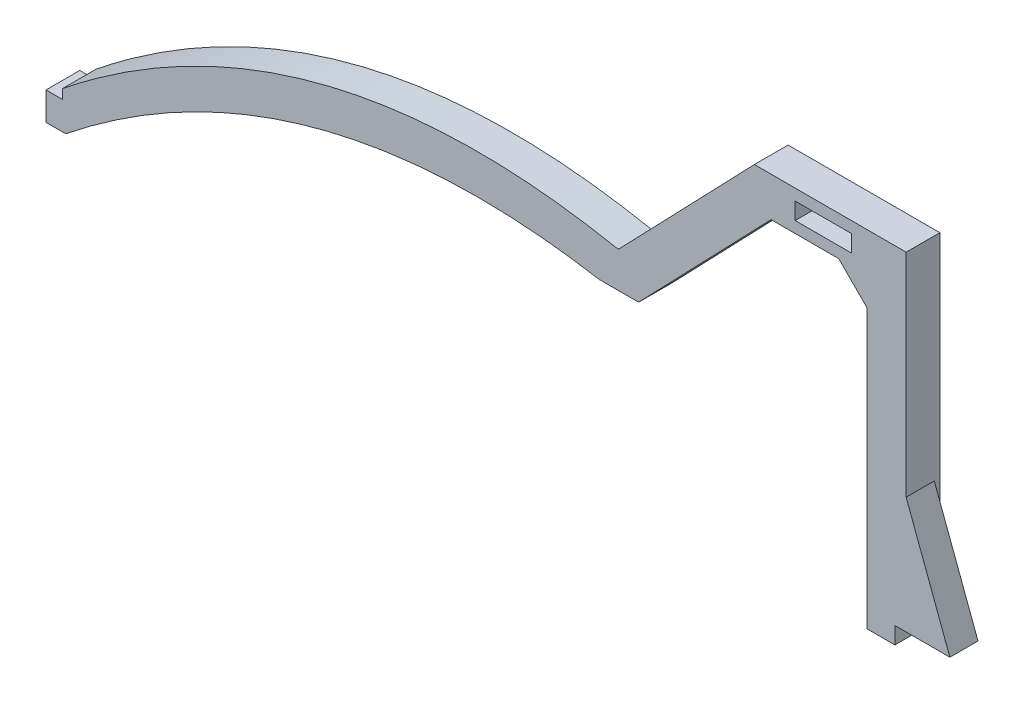
ISO-10303-21;
HEADER;
FILE_DESCRIPTION(('STEP AP214'),'2;1');
FILE_NAME('part.step','',(''),(''),'','','');
FILE_SCHEMA(('AUTOMOTIVE_DESIGN { 1 0 10303 214 1 1 1 1 }'));
ENDSEC;
DATA;
#1=APPLICATION_CONTEXT('core data for automotive mechanical design processes');
#2=APPLICATION_PROTOCOL_DEFINITION('international standard','automotive_design',2000,#1);
#3=PRODUCT_CONTEXT('',#1,'mechanical');
#4=PRODUCT('Part','Part','',(#3));
#5=PRODUCT_RELATED_PRODUCT_CATEGORY('part','',(#4));
#6=PRODUCT_DEFINITION_FORMATION('','',#4);
#7=PRODUCT_DEFINITION_CONTEXT('part definition',#1,'design');
#8=PRODUCT_DEFINITION('design','',#6,#7);
#9=PRODUCT_DEFINITION_SHAPE('','',#8);
#10=(LENGTH_UNIT() NAMED_UNIT(*) SI_UNIT(.MILLI.,.METRE.));
#11=(NAMED_UNIT(*) PLANE_ANGLE_UNIT() SI_UNIT($,.RADIAN.));
#12=(NAMED_UNIT(*) SI_UNIT($,.STERADIAN.) SOLID_ANGLE_UNIT());
#13=UNCERTAINTY_MEASURE_WITH_UNIT(LENGTH_MEASURE(1.E-05),#10,'distance_accuracy_value','');
#14=(GEOMETRIC_REPRESENTATION_CONTEXT(3) GLOBAL_UNCERTAINTY_ASSIGNED_CONTEXT((#13)) GLOBAL_UNIT_ASSIGNED_CONTEXT((#10,
#11,#12)) REPRESENTATION_CONTEXT('',''));
#15=CARTESIAN_POINT('',(0.,0.,0.));
#16=DIRECTION('',(0.,0.,1.));
#17=DIRECTION('',(1.,0.,0.));
#18=AXIS2_PLACEMENT_3D('',#15,#16,#17);
#19=CARTESIAN_POINT('',(149.489368047754,-7.,6.));
#20=DIRECTION('',(-1.,0.,0.));
#21=DIRECTION('',(0.,-1.,0.));
#22=AXIS2_PLACEMENT_3D('',#19,#20,#21);
#23=PLANE('',#22);
#24=DIRECTION('',(0.,0.,1.));
#25=VECTOR('',#24,1.);
#26=CARTESIAN_POINT('',(149.489368047754,13.7637883126724,1.));
#27=LINE('',#26,#25);
#28=CARTESIAN_POINT('',(149.489368047754,13.7637883126724,1.));
#29=VERTEX_POINT('',#28);
#30=CARTESIAN_POINT('',(149.489368047754,13.7637883126724,6.));
#31=VERTEX_POINT('',#30);
#32=EDGE_CURVE('E259',#29,#31,#27,.T.);
#33=ORIENTED_EDGE('',*,*,#32,.F.);
#34=DIRECTION('',(0.,-1.,0.));
#35=VECTOR('',#34,1.);
#36=CARTESIAN_POINT('',(149.489368047754,13.7637883126724,1.));
#37=LINE('',#36,#35);
#38=CARTESIAN_POINT('',(149.489368047754,-7.,1.));
#39=VERTEX_POINT('',#38);
#40=EDGE_CURVE('E243',#29,#39,#37,.T.);
#41=ORIENTED_EDGE('',*,*,#40,.T.);
#42=DIRECTION('',(0.,0.,-1.));
#43=VECTOR('',#42,1.);
#44=CARTESIAN_POINT('',(149.489368047754,-7.,6.));
#45=LINE('',#44,#43);
#46=CARTESIAN_POINT('',(149.489368047754,-7.,0.));
#47=VERTEX_POINT('',#46);
#48=EDGE_CURVE('E407',#39,#47,#45,.T.);
#49=ORIENTED_EDGE('',*,*,#48,.T.);
#50=DIRECTION('',(0.,1.,0.));
#51=VECTOR('',#50,1.);
#52=CARTESIAN_POINT('',(149.489368047754,-7.,0.));
#53=LINE('',#52,#51);
#54=CARTESIAN_POINT('',(149.489368047754,51.5049807047162,0.));
#55=VERTEX_POINT('',#54);
#56=EDGE_CURVE('E377',#47,#55,#53,.T.);
#57=ORIENTED_EDGE('',*,*,#56,.T.);
#58=DIRECTION('',(0.,0.,-1.));
#59=VECTOR('',#58,1.);
#60=CARTESIAN_POINT('',(149.489368047754,51.5049807047162,6.));
#61=LINE('',#60,#59);
#62=CARTESIAN_POINT('',(149.489368047754,51.5049807047162,6.));
#63=VERTEX_POINT('',#62);
#64=EDGE_CURVE('E403',#63,#55,#61,.T.);
#65=ORIENTED_EDGE('',*,*,#64,.F.);
#66=DIRECTION('',(0.,1.,0.));
#67=VECTOR('',#66,1.);
#68=CARTESIAN_POINT('',(149.489368047754,-7.,6.));
#69=LINE('',#68,#67);
#70=EDGE_CURVE('E492',#31,#63,#69,.T.);
#71=ORIENTED_EDGE('',*,*,#70,.F.);
#72=EDGE_LOOP('',(#33,#41,#49,#57,#65,#71));
#73=FACE_BOUND('',#72,.T.);
#74=ADVANCED_FACE('F39',(#73),#23,.F.);
#75=CARTESIAN_POINT('',(-0.533451553911542,1.70767056632672,6.));
#76=DIRECTION('',(0.999999999963749,-8.51478168667558E-06,0.));
#77=DIRECTION('',(8.51478168667558E-06,0.999999999963749,0.));
#78=AXIS2_PLACEMENT_3D('',#75,#76,#77);
#79=PLANE('',#78);
#80=DIRECTION('',(-8.51478168667558E-06,-0.999999999963749,0.));
#81=VECTOR('',#80,1.);
#82=CARTESIAN_POINT('',(-0.533451553911542,1.70767056632672,0.));
#83=LINE('',#82,#81);
#84=CARTESIAN_POINT('',(-0.533451553911542,1.70767056632672,0.));
#85=VERTEX_POINT('',#84);
#86=CARTESIAN_POINT('',(-0.533466094353608,0.,0.));
#87=VERTEX_POINT('',#86);
#88=EDGE_CURVE('E262',#85,#87,#83,.T.);
#89=ORIENTED_EDGE('',*,*,#88,.T.);
#90=DIRECTION('',(0.,0.,-1.));
#91=VECTOR('',#90,1.);
#92=CARTESIAN_POINT('',(-0.533466094353608,0.,6.));
#93=LINE('',#92,#91);
#94=CARTESIAN_POINT('',(-0.533466094353608,0.,6.));
#95=VERTEX_POINT('',#94);
#96=EDGE_CURVE('E324',#95,#87,#93,.T.);
#97=ORIENTED_EDGE('',*,*,#96,.F.);
#98=DIRECTION('',(-8.51478168667558E-06,-0.999999999963749,0.));
#99=VECTOR('',#98,1.);
#100=CARTESIAN_POINT('',(-0.533451553911542,1.70767056632672,6.));
#101=LINE('',#100,#99);
#102=CARTESIAN_POINT('',(-0.533451553911542,1.70767056632672,6.));
#103=VERTEX_POINT('',#102);
#104=EDGE_CURVE('E266',#103,#95,#101,.T.);
#105=ORIENTED_EDGE('',*,*,#104,.F.);
#106=DIRECTION('',(0.,0.,-1.));
#107=VECTOR('',#106,1.);
#108=CARTESIAN_POINT('',(-0.533451553911542,1.70767056632672,6.));
#109=LINE('',#108,#107);
#110=EDGE_CURVE('E326',#103,#85,#109,.T.);
#111=ORIENTED_EDGE('',*,*,#110,.T.);
#112=EDGE_LOOP('',(#89,#97,#105,#111));
#113=FACE_BOUND('',#112,.T.);
#114=ADVANCED_FACE('F309',(#113),#79,.F.);
#115=CARTESIAN_POINT('',(-0.533466094353608,0.,6.));
#116=DIRECTION('',(0.,-1.,0.));
#117=DIRECTION('',(1.,0.,0.));
#118=AXIS2_PLACEMENT_3D('',#115,#116,#117);
#119=PLANE('',#118);
#120=DIRECTION('',(-1.,0.,0.));
#121=VECTOR('',#120,1.);
#122=CARTESIAN_POINT('',(-0.533466094353608,0.,0.));
#123=LINE('',#122,#121);
#124=CARTESIAN_POINT('',(-3.5,0.,0.));
#125=VERTEX_POINT('',#124);
#126=EDGE_CURVE('E329',#87,#125,#123,.T.);
#127=ORIENTED_EDGE('',*,*,#126,.T.);
#128=DIRECTION('',(0.,0.,-1.));
#129=VECTOR('',#128,1.);
#130=CARTESIAN_POINT('',(-3.5,0.,6.));
#131=LINE('',#130,#129);
#132=CARTESIAN_POINT('',(-3.5,0.,6.));
#133=VERTEX_POINT('',#132);
#134=EDGE_CURVE('E442',#133,#125,#131,.T.);
#135=ORIENTED_EDGE('',*,*,#134,.F.);
#136=DIRECTION('',(-1.,0.,0.));
#137=VECTOR('',#136,1.);
#138=CARTESIAN_POINT('',(-0.533466094353608,0.,6.));
#139=LINE('',#138,#137);
#140=EDGE_CURVE('E270',#95,#133,#139,.T.);
#141=ORIENTED_EDGE('',*,*,#140,.F.);
#142=ORIENTED_EDGE('',*,*,#96,.T.);
#143=EDGE_LOOP('',(#127,#135,#141,#142));
#144=FACE_BOUND('',#143,.T.);
#145=ADVANCED_FACE('F306',(#144),#119,.F.);
#146=CARTESIAN_POINT('',(-3.5,0.,6.));
#147=DIRECTION('',(1.,0.,0.));
#148=DIRECTION('',(0.,1.,0.));
#149=AXIS2_PLACEMENT_3D('',#146,#147,#148);
#150=PLANE('',#149);
#151=DIRECTION('',(0.,-1.,0.));
#152=VECTOR('',#151,1.);
#153=CARTESIAN_POINT('',(-3.5,0.,0.));
#154=LINE('',#153,#152);
#155=CARTESIAN_POINT('',(-3.5,-5.,0.));
#156=VERTEX_POINT('',#155);
#157=EDGE_CURVE('E332',#125,#156,#154,.T.);
#158=ORIENTED_EDGE('',*,*,#157,.T.);
#159=DIRECTION('',(0.,0.,-1.));
#160=VECTOR('',#159,1.);
#161=CARTESIAN_POINT('',(-3.5,-5.,6.));
#162=LINE('',#161,#160);
#163=CARTESIAN_POINT('',(-3.5,-5.,6.));
#164=VERTEX_POINT('',#163);
#165=EDGE_CURVE('E438',#164,#156,#162,.T.);
#166=ORIENTED_EDGE('',*,*,#165,.F.);
#167=DIRECTION('',(0.,-1.,0.));
#168=VECTOR('',#167,1.);
#169=CARTESIAN_POINT('',(-3.5,0.,6.));
#170=LINE('',#169,#168);
#171=EDGE_CURVE('E274',#133,#164,#170,.T.);
#172=ORIENTED_EDGE('',*,*,#171,.F.);
#173=ORIENTED_EDGE('',*,*,#134,.T.);
#174=EDGE_LOOP('',(#158,#166,#172,#173));
#175=FACE_BOUND('',#174,.T.);
#176=ADVANCED_FACE('F302',(#175),#150,.F.);
#177=CARTESIAN_POINT('',(0.,-5.,6.));
#178=DIRECTION('',(0.,1.,0.));
#179=DIRECTION('',(0.,0.,1.));
#180=AXIS2_PLACEMENT_3D('',#177,#178,#179);
#181=PLANE('',#180);
#182=DIRECTION('',(1.,0.,0.));
#183=VECTOR('',#182,1.);
#184=CARTESIAN_POINT('',(0.,-5.,0.));
#185=LINE('',#184,#183);
#186=CARTESIAN_POINT('',(0.,-5.,0.));
#187=VERTEX_POINT('',#186);
#188=EDGE_CURVE('E343',#156,#187,#185,.T.);
#189=ORIENTED_EDGE('',*,*,#188,.T.);
#190=DIRECTION('',(0.,0.,-1.));
#191=VECTOR('',#190,1.);
#192=CARTESIAN_POINT('',(0.,-5.,6.));
#193=LINE('',#192,#191);
#194=CARTESIAN_POINT('',(0.,-5.,6.));
#195=VERTEX_POINT('',#194);
#196=EDGE_CURVE('E434',#195,#187,#193,.T.);
#197=ORIENTED_EDGE('',*,*,#196,.F.);
#198=DIRECTION('',(1.,0.,0.));
#199=VECTOR('',#198,1.);
#200=CARTESIAN_POINT('',(0.,-5.,6.));
#201=LINE('',#200,#199);
#202=EDGE_CURVE('E277',#164,#195,#201,.T.);
#203=ORIENTED_EDGE('',*,*,#202,.F.);
#204=ORIENTED_EDGE('',*,*,#165,.T.);
#205=EDGE_LOOP('',(#189,#197,#203,#204));
#206=FACE_BOUND('',#205,.T.);
#207=ADVANCED_FACE('F297',(#206),#181,.F.);
#208=CARTESIAN_POINT('',(0.,-5.,6.));
#209=CARTESIAN_POINT('',(42.6048179076836,29.035673617878,6.));
#210=CARTESIAN_POINT('',(94.9037876426475,20.,6.));
#211=B_SPLINE_CURVE_WITH_KNOTS('',2,(#208,#209,#210),.UNSPECIFIED.,.F.,.F.,(3,3),(0.,1.),.UNSPECIFIED.);
#212=DIRECTION('',(0.,0.,-1.));
#213=VECTOR('',#212,1.);
#214=SURFACE_OF_LINEAR_EXTRUSION('',#211,#213);
#215=CARTESIAN_POINT('',(0.,-5.,0.));
#216=CARTESIAN_POINT('',(42.6048179076836,29.035673617878,0.));
#217=CARTESIAN_POINT('',(94.9037876426475,20.,0.));
#218=B_SPLINE_CURVE_WITH_KNOTS('',2,(#215,#216,#217),.UNSPECIFIED.,.F.,.F.,(3,3),(0.,1.),.UNSPECIFIED.);
#219=CARTESIAN_POINT('',(94.9037876426475,20.,0.));
#220=VERTEX_POINT('',#219);
#221=EDGE_CURVE('E346',#187,#220,#218,.T.);
#222=ORIENTED_EDGE('',*,*,#221,.T.);
#223=DIRECTION('',(0.,0.,-1.));
#224=VECTOR('',#223,1.);
#225=CARTESIAN_POINT('',(94.9037876426475,20.,6.));
#226=LINE('',#225,#224);
#227=CARTESIAN_POINT('',(94.9037876426475,20.,6.));
#228=VERTEX_POINT('',#227);
#229=EDGE_CURVE('E430',#228,#220,#226,.T.);
#230=ORIENTED_EDGE('',*,*,#229,.F.);
#231=EDGE_CURVE('E280',#195,#228,#211,.T.);
#232=ORIENTED_EDGE('',*,*,#231,.F.);
#233=ORIENTED_EDGE('',*,*,#196,.T.);
#234=EDGE_LOOP('',(#222,#230,#232,#233));
#235=FACE_BOUND('',#234,.T.);
#236=ADVANCED_FACE('F292',(#235),#214,.F.);
#237=CARTESIAN_POINT('',(94.9037876426475,20.,6.));
#238=DIRECTION('',(0.,1.,0.));
#239=DIRECTION('',(-1.,0.,0.));
#240=AXIS2_PLACEMENT_3D('',#237,#238,#239);
#241=PLANE('',#240);
#242=DIRECTION('',(1.,0.,0.));
#243=VECTOR('',#242,1.);
#244=CARTESIAN_POINT('',(94.9037876426475,20.,0.));
#245=LINE('',#244,#243);
#246=CARTESIAN_POINT('',(101.903787642647,20.,0.));
#247=VERTEX_POINT('',#246);
#248=EDGE_CURVE('E351',#220,#247,#245,.T.);
#249=ORIENTED_EDGE('',*,*,#248,.T.);
#250=DIRECTION('',(0.,0.,-1.));
#251=VECTOR('',#250,1.);
#252=CARTESIAN_POINT('',(101.903787642647,20.,6.));
#253=LINE('',#252,#251);
#254=CARTESIAN_POINT('',(101.903787642647,20.,6.));
#255=VERTEX_POINT('',#254);
#256=EDGE_CURVE('E426',#255,#247,#253,.T.);
#257=ORIENTED_EDGE('',*,*,#256,.F.);
#258=DIRECTION('',(1.,0.,0.));
#259=VECTOR('',#258,1.);
#260=CARTESIAN_POINT('',(94.9037876426475,20.,6.));
#261=LINE('',#260,#259);
#262=EDGE_CURVE('E286',#228,#255,#261,.T.);
#263=ORIENTED_EDGE('',*,*,#262,.F.);
#264=ORIENTED_EDGE('',*,*,#229,.T.);
#265=EDGE_LOOP('',(#249,#257,#263,#264));
#266=FACE_BOUND('',#265,.T.);
#267=ADVANCED_FACE('F296',(#266),#241,.F.);
#268=CARTESIAN_POINT('',(101.903787642647,20.,6.));
#269=DIRECTION('',(-0.720788259928802,0.693155310409442,0.));
#270=DIRECTION('',(-0.693155310409442,-0.720788259928802,0.));
#271=AXIS2_PLACEMENT_3D('',#268,#269,#270);
#272=PLANE('',#271);
#273=DIRECTION('',(0.693155310409442,0.720788259928802,0.));
#274=VECTOR('',#273,1.);
#275=CARTESIAN_POINT('',(101.903787642647,20.,0.));
#276=LINE('',#275,#274);
#277=CARTESIAN_POINT('',(125.469317842366,44.5049807047162,0.));
#278=VERTEX_POINT('',#277);
#279=EDGE_CURVE('E357',#247,#278,#276,.T.);
#280=ORIENTED_EDGE('',*,*,#279,.T.);
#281=DIRECTION('',(0.,0.,-1.));
#282=VECTOR('',#281,1.);
#283=CARTESIAN_POINT('',(125.469317842366,44.5049807047162,6.));
#284=LINE('',#283,#282);
#285=CARTESIAN_POINT('',(125.469317842366,44.5049807047162,6.));
#286=VERTEX_POINT('',#285);
#287=EDGE_CURVE('E422',#286,#278,#284,.T.);
#288=ORIENTED_EDGE('',*,*,#287,.F.);
#289=DIRECTION('',(0.693155310409442,0.720788259928802,0.));
#290=VECTOR('',#289,1.);
#291=CARTESIAN_POINT('',(101.903787642647,20.,6.));
#292=LINE('',#291,#290);
#293=EDGE_CURVE('E484',#255,#286,#292,.T.);
#294=ORIENTED_EDGE('',*,*,#293,.F.);
#295=ORIENTED_EDGE('',*,*,#256,.T.);
#296=EDGE_LOOP('',(#280,#288,#294,#295));
#297=FACE_BOUND('',#296,.T.);
#298=ADVANCED_FACE('F566',(#297),#272,.F.);
#299=CARTESIAN_POINT('',(125.469317842366,44.5049807047162,6.));
#300=DIRECTION('',(0.,1.,0.));
#301=DIRECTION('',(-1.,0.,0.));
#302=AXIS2_PLACEMENT_3D('',#299,#300,#301);
#303=PLANE('',#302);
#304=DIRECTION('',(1.,0.,0.));
#305=VECTOR('',#304,1.);
#306=CARTESIAN_POINT('',(125.469317842366,44.5049807047162,0.));
#307=LINE('',#306,#305);
#308=CARTESIAN_POINT('',(137.489368047754,44.5049807047162,0.));
#309=VERTEX_POINT('',#308);
#310=EDGE_CURVE('E360',#278,#309,#307,.T.);
#311=ORIENTED_EDGE('',*,*,#310,.T.);
#312=DIRECTION('',(0.,0.,1.));
#313=VECTOR('',#312,1.);
#314=CARTESIAN_POINT('',(137.489368047754,44.5049807047162,6.));
#315=LINE('',#314,#313);
#316=CARTESIAN_POINT('',(137.489368047754,44.5049807047162,6.));
#317=VERTEX_POINT('',#316);
#318=EDGE_CURVE('E452',#309,#317,#315,.T.);
#319=ORIENTED_EDGE('',*,*,#318,.T.);
#320=DIRECTION('',(1.,0.,0.));
#321=VECTOR('',#320,1.);
#322=CARTESIAN_POINT('',(125.469317842366,44.5049807047162,6.));
#323=LINE('',#322,#321);
#324=EDGE_CURVE('E473',#286,#317,#323,.T.);
#325=ORIENTED_EDGE('',*,*,#324,.F.);
#326=ORIENTED_EDGE('',*,*,#287,.T.);
#327=EDGE_LOOP('',(#311,#319,#325,#326));
#328=FACE_BOUND('',#327,.T.);
#329=ADVANCED_FACE('F463',(#328),#303,.F.);
#330=CARTESIAN_POINT('',(142.489368047754,44.5049807047162,6.));
#331=DIRECTION('',(1.,0.,0.));
#332=DIRECTION('',(0.,0.,-1.));
#333=AXIS2_PLACEMENT_3D('',#330,#331,#332);
#334=PLANE('',#333);
#335=DIRECTION('',(0.,-1.,0.));
#336=VECTOR('',#335,1.);
#337=CARTESIAN_POINT('',(142.489368047754,44.5049807047162,6.));
#338=LINE('',#337,#336);
#339=CARTESIAN_POINT('',(142.489368047754,39.5049807047162,6.));
#340=VERTEX_POINT('',#339);
#341=CARTESIAN_POINT('',(142.489368047754,-10.,6.));
#342=VERTEX_POINT('',#341);
#343=EDGE_CURVE('E471',#340,#342,#338,.T.);
#344=ORIENTED_EDGE('',*,*,#343,.F.);
#345=DIRECTION('',(0.,0.,-1.));
#346=VECTOR('',#345,1.);
#347=CARTESIAN_POINT('',(142.489368047754,39.5049807047162,0.));
#348=LINE('',#347,#346);
#349=CARTESIAN_POINT('',(142.489368047754,39.5049807047162,0.));
#350=VERTEX_POINT('',#349);
#351=EDGE_CURVE('E448',#340,#350,#348,.T.);
#352=ORIENTED_EDGE('',*,*,#351,.T.);
#353=DIRECTION('',(0.,-1.,0.));
#354=VECTOR('',#353,1.);
#355=CARTESIAN_POINT('',(142.489368047754,44.5049807047162,0.));
#356=LINE('',#355,#354);
#357=CARTESIAN_POINT('',(142.489368047754,-10.,0.));
#358=VERTEX_POINT('',#357);
#359=EDGE_CURVE('E364',#350,#358,#356,.T.);
#360=ORIENTED_EDGE('',*,*,#359,.T.);
#361=DIRECTION('',(0.,0.,-1.));
#362=VECTOR('',#361,1.);
#363=CARTESIAN_POINT('',(142.489368047754,-10.,6.));
#364=LINE('',#363,#362);
#365=EDGE_CURVE('E418',#342,#358,#364,.T.);
#366=ORIENTED_EDGE('',*,*,#365,.F.);
#367=EDGE_LOOP('',(#344,#352,#360,#366));
#368=FACE_BOUND('',#367,.T.);
#369=ADVANCED_FACE('F475',(#368),#334,.F.);
#370=CARTESIAN_POINT('',(142.489368047754,-10.,6.));
#371=DIRECTION('',(0.,1.,0.));
#372=DIRECTION('',(-1.,0.,0.));
#373=AXIS2_PLACEMENT_3D('',#370,#371,#372);
#374=PLANE('',#373);
#375=DIRECTION('',(1.,0.,0.));
#376=VECTOR('',#375,1.);
#377=CARTESIAN_POINT('',(142.489368047754,-10.,0.));
#378=LINE('',#377,#376);
#379=CARTESIAN_POINT('',(147.489368047754,-10.,0.));
#380=VERTEX_POINT('',#379);
#381=EDGE_CURVE('E367',#358,#380,#378,.T.);
#382=ORIENTED_EDGE('',*,*,#381,.T.);
#383=DIRECTION('',(0.,0.,-1.));
#384=VECTOR('',#383,1.);
#385=CARTESIAN_POINT('',(147.489368047754,-10.,6.));
#386=LINE('',#385,#384);
#387=CARTESIAN_POINT('',(147.489368047754,-10.,6.));
#388=VERTEX_POINT('',#387);
#389=EDGE_CURVE('E414',#388,#380,#386,.T.);
#390=ORIENTED_EDGE('',*,*,#389,.F.);
#391=DIRECTION('',(1.,0.,0.));
#392=VECTOR('',#391,1.);
#393=CARTESIAN_POINT('',(142.489368047754,-10.,6.));
#394=LINE('',#393,#392);
#395=EDGE_CURVE('E478',#342,#388,#394,.T.);
#396=ORIENTED_EDGE('',*,*,#395,.F.);
#397=ORIENTED_EDGE('',*,*,#365,.T.);
#398=EDGE_LOOP('',(#382,#390,#396,#397));
#399=FACE_BOUND('',#398,.T.);
#400=ADVANCED_FACE('F529',(#399),#374,.F.);
#401=CARTESIAN_POINT('',(147.489368047754,-10.,6.));
#402=DIRECTION('',(-1.,0.,0.));
#403=DIRECTION('',(0.,0.,1.));
#404=AXIS2_PLACEMENT_3D('',#401,#402,#403);
#405=PLANE('',#404);
#406=DIRECTION('',(0.,1.,0.));
#407=VECTOR('',#406,1.);
#408=CARTESIAN_POINT('',(147.489368047754,-10.,0.));
#409=LINE('',#408,#407);
#410=CARTESIAN_POINT('',(147.489368047754,-7.,0.));
#411=VERTEX_POINT('',#410);
#412=EDGE_CURVE('E370',#380,#411,#409,.T.);
#413=ORIENTED_EDGE('',*,*,#412,.T.);
#414=DIRECTION('',(0.,0.,-1.));
#415=VECTOR('',#414,1.);
#416=CARTESIAN_POINT('',(147.489368047754,-7.,6.));
#417=LINE('',#416,#415);
#418=CARTESIAN_POINT('',(147.489368047754,-7.,6.));
#419=VERTEX_POINT('',#418);
#420=EDGE_CURVE('E410',#419,#411,#417,.T.);
#421=ORIENTED_EDGE('',*,*,#420,.F.);
#422=DIRECTION('',(0.,1.,0.));
#423=VECTOR('',#422,1.);
#424=CARTESIAN_POINT('',(147.489368047754,-10.,6.));
#425=LINE('',#424,#423);
#426=EDGE_CURVE('E482',#388,#419,#425,.T.);
#427=ORIENTED_EDGE('',*,*,#426,.F.);
#428=ORIENTED_EDGE('',*,*,#389,.T.);
#429=EDGE_LOOP('',(#413,#421,#427,#428));
#430=FACE_BOUND('',#429,.T.);
#431=ADVANCED_FACE('F526',(#430),#405,.F.);
#432=CARTESIAN_POINT('',(147.489368047754,-7.,6.));
#433=DIRECTION('',(0.,1.,0.));
#434=DIRECTION('',(0.,0.,1.));
#435=AXIS2_PLACEMENT_3D('',#432,#433,#434);
#436=PLANE('',#435);
#437=DIRECTION('',(1.,0.,0.));
#438=VECTOR('',#437,1.);
#439=CARTESIAN_POINT('',(147.489368047754,-7.,0.));
#440=LINE('',#439,#438);
#441=EDGE_CURVE('E373',#411,#47,#440,.T.);
#442=ORIENTED_EDGE('',*,*,#441,.T.);
#443=ORIENTED_EDGE('',*,*,#48,.F.);
#444=DIRECTION('',(1.,0.,0.));
#445=VECTOR('',#444,1.);
#446=CARTESIAN_POINT('',(149.489368047754,-7.,1.));
#447=LINE('',#446,#445);
#448=CARTESIAN_POINT('',(157.267488672421,-7.,1.));
#449=VERTEX_POINT('',#448);
#450=EDGE_CURVE('E247',#39,#449,#447,.T.);
#451=ORIENTED_EDGE('',*,*,#450,.T.);
#452=DIRECTION('',(0.,0.,1.));
#453=VECTOR('',#452,1.);
#454=CARTESIAN_POINT('',(157.267488672421,-7.,1.));
#455=LINE('',#454,#453);
#456=CARTESIAN_POINT('',(157.267488672421,-7.,6.));
#457=VERTEX_POINT('',#456);
#458=EDGE_CURVE('E255',#449,#457,#455,.T.);
#459=ORIENTED_EDGE('',*,*,#458,.T.);
#460=DIRECTION('',(1.,0.,0.));
#461=VECTOR('',#460,1.);
#462=CARTESIAN_POINT('',(147.489368047754,-7.,6.));
#463=LINE('',#462,#461);
#464=EDGE_CURVE('E489',#419,#457,#463,.T.);
#465=ORIENTED_EDGE('',*,*,#464,.F.);
#466=ORIENTED_EDGE('',*,*,#420,.T.);
#467=EDGE_LOOP('',(#442,#443,#451,#459,#465,#466));
#468=FACE_BOUND('',#467,.T.);
#469=ADVANCED_FACE('F521',(#468),#436,.F.);
#470=CARTESIAN_POINT('',(122.489368047754,51.5049807047162,6.));
#471=DIRECTION('',(0.,-1.,0.));
#472=DIRECTION('',(1.,0.,0.));
#473=AXIS2_PLACEMENT_3D('',#470,#471,#472);
#474=PLANE('',#473);
#475=DIRECTION('',(-1.,0.,0.));
#476=VECTOR('',#475,1.);
#477=CARTESIAN_POINT('',(122.489368047754,51.5049807047162,0.));
#478=LINE('',#477,#476);
#479=CARTESIAN_POINT('',(122.489368047754,51.5049807047162,0.));
#480=VERTEX_POINT('',#479);
#481=EDGE_CURVE('E380',#55,#480,#478,.T.);
#482=ORIENTED_EDGE('',*,*,#481,.T.);
#483=DIRECTION('',(0.,0.,-1.));
#484=VECTOR('',#483,1.);
#485=CARTESIAN_POINT('',(122.489368047754,51.5049807047162,6.));
#486=LINE('',#485,#484);
#487=CARTESIAN_POINT('',(122.489368047754,51.5049807047162,6.));
#488=VERTEX_POINT('',#487);
#489=EDGE_CURVE('E399',#488,#480,#486,.T.);
#490=ORIENTED_EDGE('',*,*,#489,.F.);
#491=DIRECTION('',(-1.,0.,0.));
#492=VECTOR('',#491,1.);
#493=CARTESIAN_POINT('',(122.489368047754,51.5049807047162,6.));
#494=LINE('',#493,#492);
#495=EDGE_CURVE('E495',#63,#488,#494,.T.);
#496=ORIENTED_EDGE('',*,*,#495,.F.);
#497=ORIENTED_EDGE('',*,*,#64,.T.);
#498=EDGE_LOOP('',(#482,#490,#496,#497));
#499=FACE_BOUND('',#498,.T.);
#500=ADVANCED_FACE('F513',(#499),#474,.F.);
#501=CARTESIAN_POINT('',(98.2958228569671,26.3469489076645,6.));
#502=DIRECTION('',(0.720788259928802,-0.693155310409442,0.));
#503=DIRECTION('',(0.693155310409442,0.720788259928802,0.));
#504=AXIS2_PLACEMENT_3D('',#501,#502,#503);
#505=PLANE('',#504);
#506=DIRECTION('',(-0.693155310409442,-0.720788259928802,0.));
#507=VECTOR('',#506,1.);
#508=CARTESIAN_POINT('',(98.2958228569671,26.3469489076645,0.));
#509=LINE('',#508,#507);
#510=CARTESIAN_POINT('',(98.2958228569671,26.3469489076645,0.));
#511=VERTEX_POINT('',#510);
#512=EDGE_CURVE('E383',#480,#511,#509,.T.);
#513=ORIENTED_EDGE('',*,*,#512,.T.);
#514=DIRECTION('',(0.,0.,-1.));
#515=VECTOR('',#514,1.);
#516=CARTESIAN_POINT('',(98.2958228569671,26.3469489076645,6.));
#517=LINE('',#516,#515);
#518=CARTESIAN_POINT('',(98.2958228569671,26.3469489076645,6.));
#519=VERTEX_POINT('',#518);
#520=EDGE_CURVE('E395',#519,#511,#517,.T.);
#521=ORIENTED_EDGE('',*,*,#520,.F.);
#522=DIRECTION('',(-0.693155310409442,-0.720788259928802,0.));
#523=VECTOR('',#522,1.);
#524=CARTESIAN_POINT('',(98.2958228569671,26.3469489076645,6.));
#525=LINE('',#524,#523);
#526=EDGE_CURVE('E497',#488,#519,#525,.T.);
#527=ORIENTED_EDGE('',*,*,#526,.F.);
#528=ORIENTED_EDGE('',*,*,#489,.T.);
#529=EDGE_LOOP('',(#513,#521,#527,#528));
#530=FACE_BOUND('',#529,.T.);
#531=ADVANCED_FACE('F509',(#530),#505,.F.);
#532=CARTESIAN_POINT('',(98.2958228569671,26.3469489076645,6.));
#533=CARTESIAN_POINT('',(98.0268187157122,26.4004726348545,6.));
#534=CARTESIAN_POINT('',(61.7178736480908,33.5155245541601,6.));
#535=CARTESIAN_POINT('',(28.7998876093949,25.1881012839885,6.));
#536=CARTESIAN_POINT('',(-0.533451553911542,1.70767056632672,6.));
#537=B_SPLINE_CURVE_WITH_KNOTS('',3,(#532,#533,#534,#535,#536),.UNSPECIFIED.,.F.,.F.,(4,1,4),
(0.,0.00745886026553855,1.00745886026554),.UNSPECIFIED.);
#538=DIRECTION('',(0.,0.,-1.));
#539=VECTOR('',#538,1.);
#540=SURFACE_OF_LINEAR_EXTRUSION('',#537,#539);
#541=CARTESIAN_POINT('',(98.2958228569671,26.3469489076645,0.));
#542=CARTESIAN_POINT('',(98.0268187157122,26.4004726348545,0.));
#543=CARTESIAN_POINT('',(61.7178736480908,33.5155245541601,0.));
#544=CARTESIAN_POINT('',(28.7998876093949,25.1881012839885,0.));
#545=CARTESIAN_POINT('',(-0.533451553911542,1.70767056632672,0.));
#546=B_SPLINE_CURVE_WITH_KNOTS('',3,(#541,#542,#543,#544,#545),.UNSPECIFIED.,.F.,.F.,(4,1,4),
(0.,0.00745886026553855,1.00745886026554),.UNSPECIFIED.);
#547=EDGE_CURVE('E271',#511,#85,#546,.T.);
#548=ORIENTED_EDGE('',*,*,#547,.T.);
#549=ORIENTED_EDGE('',*,*,#110,.F.);
#550=EDGE_CURVE('E335',#519,#103,#537,.T.);
#551=ORIENTED_EDGE('',*,*,#550,.F.);
#552=ORIENTED_EDGE('',*,*,#520,.T.);
#553=EDGE_LOOP('',(#548,#549,#551,#552));
#554=FACE_BOUND('',#553,.T.);
#555=ADVANCED_FACE('F504',(#554),#540,.F.);
#556=CARTESIAN_POINT('',(45.0283558645037,18.267836808939,6.));
#557=DIRECTION('',(0.,0.,1.));
#558=DIRECTION('',(1.,0.,0.));
#559=AXIS2_PLACEMENT_3D('',#556,#557,#558);
#560=PLANE('',#559);
#561=DIRECTION('',(0.,-1.,0.));
#562=VECTOR('',#561,1.);
#563=CARTESIAN_POINT('',(129.74873736035,49.5049807047162,6.));
#564=LINE('',#563,#562);
#565=CARTESIAN_POINT('',(129.74873736035,49.5049807047162,6.));
#566=VERTEX_POINT('',#565);
#567=CARTESIAN_POINT('',(129.74873736035,46.5049807047162,6.));
#568=VERTEX_POINT('',#567);
#569=EDGE_CURVE('E55',#566,#568,#564,.T.);
#570=ORIENTED_EDGE('',*,*,#569,.F.);
#571=DIRECTION('',(-1.,0.,0.));
#572=VECTOR('',#571,1.);
#573=CARTESIAN_POINT('',(129.74873736035,49.5049807047162,6.));
#574=LINE('',#573,#572);
#575=CARTESIAN_POINT('',(139.74873736035,49.5049807047162,6.));
#576=VERTEX_POINT('',#575);
#577=EDGE_CURVE('E215',#576,#566,#574,.T.);
#578=ORIENTED_EDGE('',*,*,#577,.F.);
#579=DIRECTION('',(0.,1.,0.));
#580=VECTOR('',#579,1.);
#581=CARTESIAN_POINT('',(139.74873736035,49.5049807047162,6.));
#582=LINE('',#581,#580);
#583=CARTESIAN_POINT('',(139.74873736035,46.5049807047162,6.));
#584=VERTEX_POINT('',#583);
#585=EDGE_CURVE('E219',#584,#576,#582,.T.);
#586=ORIENTED_EDGE('',*,*,#585,.F.);
#587=DIRECTION('',(1.,0.,0.));
#588=VECTOR('',#587,1.);
#589=CARTESIAN_POINT('',(129.74873736035,46.5049807047162,6.));
#590=LINE('',#589,#588);
#591=EDGE_CURVE('E228',#568,#584,#590,.T.);
#592=ORIENTED_EDGE('',*,*,#591,.F.);
#593=EDGE_LOOP('',(#570,#578,#586,#592));
#594=FACE_BOUND('',#593,.T.);
#595=ORIENTED_EDGE('',*,*,#104,.T.);
#596=ORIENTED_EDGE('',*,*,#140,.T.);
#597=ORIENTED_EDGE('',*,*,#171,.T.);
#598=ORIENTED_EDGE('',*,*,#202,.T.);
#599=ORIENTED_EDGE('',*,*,#231,.T.);
#600=ORIENTED_EDGE('',*,*,#262,.T.);
#601=ORIENTED_EDGE('',*,*,#293,.T.);
#602=ORIENTED_EDGE('',*,*,#324,.T.);
#603=DIRECTION('',(-0.707106781186547,0.707106781186548,0.));
#604=VECTOR('',#603,1.);
#605=CARTESIAN_POINT('',(142.489368047754,39.5049807047162,6.));
#606=LINE('',#605,#604);
#607=EDGE_CURVE('E11',#317,#340,#606,.F.);
#608=ORIENTED_EDGE('',*,*,#607,.T.);
#609=ORIENTED_EDGE('',*,*,#343,.T.);
#610=ORIENTED_EDGE('',*,*,#395,.T.);
#611=ORIENTED_EDGE('',*,*,#426,.T.);
#612=ORIENTED_EDGE('',*,*,#464,.T.);
#613=DIRECTION('',(-0.350795238718328,0.936452188044084,0.));
#614=VECTOR('',#613,1.);
#615=CARTESIAN_POINT('',(157.267488672421,-7.,6.));
#616=LINE('',#615,#614);
#617=EDGE_CURVE('E237',#457,#31,#616,.T.);
#618=ORIENTED_EDGE('',*,*,#617,.T.);
#619=ORIENTED_EDGE('',*,*,#70,.T.);
#620=ORIENTED_EDGE('',*,*,#495,.T.);
#621=ORIENTED_EDGE('',*,*,#526,.T.);
#622=ORIENTED_EDGE('',*,*,#550,.T.);
#623=EDGE_LOOP('',(#595,#596,#597,#598,#599,#600,#601,#602,#608,#609,#610,#611,#612,#618,#619,
#620,#621,#622));
#624=FACE_BOUND('',#623,.T.);
#625=ADVANCED_FACE('F470',(#594,#624),#560,.T.);
#626=CARTESIAN_POINT('',(45.0283558645037,18.267836808939,0.));
#627=DIRECTION('',(0.,0.,1.));
#628=DIRECTION('',(1.,0.,0.));
#629=AXIS2_PLACEMENT_3D('',#626,#627,#628);
#630=PLANE('',#629);
#631=DIRECTION('',(-1.,0.,0.));
#632=VECTOR('',#631,1.);
#633=CARTESIAN_POINT('',(129.74873736035,49.5049807047162,0.));
#634=LINE('',#633,#632);
#635=CARTESIAN_POINT('',(139.74873736035,49.5049807047162,0.));
#636=VERTEX_POINT('',#635);
#637=CARTESIAN_POINT('',(129.74873736035,49.5049807047162,0.));
#638=VERTEX_POINT('',#637);
#639=EDGE_CURVE('E203',#636,#638,#634,.T.);
#640=ORIENTED_EDGE('',*,*,#639,.T.);
#641=DIRECTION('',(0.,-1.,0.));
#642=VECTOR('',#641,1.);
#643=CARTESIAN_POINT('',(129.74873736035,49.5049807047162,0.));
#644=LINE('',#643,#642);
#645=CARTESIAN_POINT('',(129.74873736035,46.5049807047162,0.));
#646=VERTEX_POINT('',#645);
#647=EDGE_CURVE('E196',#638,#646,#644,.T.);
#648=ORIENTED_EDGE('',*,*,#647,.T.);
#649=DIRECTION('',(1.,0.,0.));
#650=VECTOR('',#649,1.);
#651=CARTESIAN_POINT('',(129.74873736035,46.5049807047162,0.));
#652=LINE('',#651,#650);
#653=CARTESIAN_POINT('',(139.74873736035,46.5049807047162,0.));
#654=VERTEX_POINT('',#653);
#655=EDGE_CURVE('E206',#646,#654,#652,.T.);
#656=ORIENTED_EDGE('',*,*,#655,.T.);
#657=DIRECTION('',(0.,1.,0.));
#658=VECTOR('',#657,1.);
#659=CARTESIAN_POINT('',(139.74873736035,49.5049807047162,0.));
#660=LINE('',#659,#658);
#661=EDGE_CURVE('E63',#654,#636,#660,.T.);
#662=ORIENTED_EDGE('',*,*,#661,.T.);
#663=EDGE_LOOP('',(#640,#648,#656,#662));
#664=FACE_BOUND('',#663,.T.);
#665=ORIENTED_EDGE('',*,*,#88,.F.);
#666=ORIENTED_EDGE('',*,*,#547,.F.);
#667=ORIENTED_EDGE('',*,*,#512,.F.);
#668=ORIENTED_EDGE('',*,*,#481,.F.);
#669=ORIENTED_EDGE('',*,*,#56,.F.);
#670=ORIENTED_EDGE('',*,*,#441,.F.);
#671=ORIENTED_EDGE('',*,*,#412,.F.);
#672=ORIENTED_EDGE('',*,*,#381,.F.);
#673=ORIENTED_EDGE('',*,*,#359,.F.);
#674=DIRECTION('',(0.707106781186547,-0.707106781186548,0.));
#675=VECTOR('',#674,1.);
#676=CARTESIAN_POINT('',(104.377433904017,77.6169148484526,0.));
#677=LINE('',#676,#675);
#678=EDGE_CURVE('E48',#350,#309,#677,.F.);
#679=ORIENTED_EDGE('',*,*,#678,.T.);
#680=ORIENTED_EDGE('',*,*,#310,.F.);
#681=ORIENTED_EDGE('',*,*,#279,.F.);
#682=ORIENTED_EDGE('',*,*,#248,.F.);
#683=ORIENTED_EDGE('',*,*,#221,.F.);
#684=ORIENTED_EDGE('',*,*,#188,.F.);
#685=ORIENTED_EDGE('',*,*,#157,.F.);
#686=ORIENTED_EDGE('',*,*,#126,.F.);
#687=EDGE_LOOP('',(#665,#666,#667,#668,#669,#670,#671,#672,#673,#679,#680,#681,#682,#683,#684,
#685,#686));
#688=FACE_BOUND('',#687,.T.);
#689=ADVANCED_FACE('F211',(#664,#688),#630,.F.);
#690=CARTESIAN_POINT('',(157.267488672421,-7.,1.));
#691=DIRECTION('',(0.936452188044084,0.350795238718328,0.));
#692=DIRECTION('',(-0.350795238718328,0.936452188044084,0.));
#693=AXIS2_PLACEMENT_3D('',#690,#691,#692);
#694=PLANE('',#693);
#695=ORIENTED_EDGE('',*,*,#617,.F.);
#696=ORIENTED_EDGE('',*,*,#458,.F.);
#697=DIRECTION('',(-0.350795238718328,0.936452188044084,0.));
#698=VECTOR('',#697,1.);
#699=CARTESIAN_POINT('',(157.267488672421,-7.,1.));
#700=LINE('',#699,#698);
#701=EDGE_CURVE('E251',#449,#29,#700,.T.);
#702=ORIENTED_EDGE('',*,*,#701,.T.);
#703=ORIENTED_EDGE('',*,*,#32,.T.);
#704=EDGE_LOOP('',(#695,#696,#702,#703));
#705=FACE_BOUND('',#704,.T.);
#706=ADVANCED_FACE('F533',(#705),#694,.T.);
#707=CARTESIAN_POINT('',(0.,0.,1.));
#708=DIRECTION('',(0.,0.,1.));
#709=DIRECTION('',(1.,0.,0.));
#710=AXIS2_PLACEMENT_3D('',#707,#708,#709);
#711=PLANE('',#710);
#712=ORIENTED_EDGE('',*,*,#40,.F.);
#713=ORIENTED_EDGE('',*,*,#701,.F.);
#714=ORIENTED_EDGE('',*,*,#450,.F.);
#715=EDGE_LOOP('',(#712,#713,#714));
#716=FACE_BOUND('',#715,.T.);
#717=ADVANCED_FACE('F535',(#716),#711,.F.);
#718=CARTESIAN_POINT('',(142.489368047754,39.5049807047162,6.));
#719=DIRECTION('',(-0.707106781186548,-0.707106781186547,0.));
#720=DIRECTION('',(0.,0.,1.));
#721=AXIS2_PLACEMENT_3D('',#718,#719,#720);
#722=PLANE('',#721);
#723=ORIENTED_EDGE('',*,*,#607,.F.);
#724=ORIENTED_EDGE('',*,*,#318,.F.);
#725=ORIENTED_EDGE('',*,*,#678,.F.);
#726=ORIENTED_EDGE('',*,*,#351,.F.);
#727=EDGE_LOOP('',(#723,#724,#725,#726));
#728=FACE_BOUND('',#727,.T.);
#729=ADVANCED_FACE('F41',(#728),#722,.T.);
#730=CARTESIAN_POINT('',(129.74873736035,49.5049807047162,0.));
#731=DIRECTION('',(-1.,0.,0.));
#732=DIRECTION('',(0.,0.,1.));
#733=AXIS2_PLACEMENT_3D('',#730,#731,#732);
#734=PLANE('',#733);
#735=ORIENTED_EDGE('',*,*,#569,.T.);
#736=DIRECTION('',(0.,0.,1.));
#737=VECTOR('',#736,1.);
#738=CARTESIAN_POINT('',(129.74873736035,46.5049807047162,0.));
#739=LINE('',#738,#737);
#740=EDGE_CURVE('E192',#646,#568,#739,.T.);
#741=ORIENTED_EDGE('',*,*,#740,.F.);
#742=ORIENTED_EDGE('',*,*,#647,.F.);
#743=DIRECTION('',(0.,0.,1.));
#744=VECTOR('',#743,1.);
#745=CARTESIAN_POINT('',(129.74873736035,49.5049807047162,0.));
#746=LINE('',#745,#744);
#747=EDGE_CURVE('E234',#638,#566,#746,.T.);
#748=ORIENTED_EDGE('',*,*,#747,.T.);
#749=EDGE_LOOP('',(#735,#741,#742,#748));
#750=FACE_BOUND('',#749,.T.);
#751=ADVANCED_FACE('F194',(#750),#734,.F.);
#752=CARTESIAN_POINT('',(129.74873736035,49.5049807047162,0.));
#753=DIRECTION('',(0.,1.,0.));
#754=DIRECTION('',(0.,0.,1.));
#755=AXIS2_PLACEMENT_3D('',#752,#753,#754);
#756=PLANE('',#755);
#757=ORIENTED_EDGE('',*,*,#577,.T.);
#758=ORIENTED_EDGE('',*,*,#747,.F.);
#759=ORIENTED_EDGE('',*,*,#639,.F.);
#760=DIRECTION('',(0.,0.,1.));
#761=VECTOR('',#760,1.);
#762=CARTESIAN_POINT('',(139.74873736035,49.5049807047162,0.));
#763=LINE('',#762,#761);
#764=EDGE_CURVE('E238',#636,#576,#763,.T.);
#765=ORIENTED_EDGE('',*,*,#764,.T.);
#766=EDGE_LOOP('',(#757,#758,#759,#765));
#767=FACE_BOUND('',#766,.T.);
#768=ADVANCED_FACE('F710',(#767),#756,.F.);
#769=CARTESIAN_POINT('',(139.74873736035,49.5049807047162,0.));
#770=DIRECTION('',(1.,0.,0.));
#771=DIRECTION('',(0.,0.,-1.));
#772=AXIS2_PLACEMENT_3D('',#769,#770,#771);
#773=PLANE('',#772);
#774=ORIENTED_EDGE('',*,*,#585,.T.);
#775=ORIENTED_EDGE('',*,*,#764,.F.);
#776=ORIENTED_EDGE('',*,*,#661,.F.);
#777=DIRECTION('',(0.,0.,1.));
#778=VECTOR('',#777,1.);
#779=CARTESIAN_POINT('',(139.74873736035,46.5049807047162,0.));
#780=LINE('',#779,#778);
#781=EDGE_CURVE('E202',#654,#584,#780,.T.);
#782=ORIENTED_EDGE('',*,*,#781,.T.);
#783=EDGE_LOOP('',(#774,#775,#776,#782));
#784=FACE_BOUND('',#783,.T.);
#785=ADVANCED_FACE('F717',(#784),#773,.F.);
#786=CARTESIAN_POINT('',(129.74873736035,46.5049807047162,0.));
#787=DIRECTION('',(0.,-1.,0.));
#788=DIRECTION('',(0.,0.,-1.));
#789=AXIS2_PLACEMENT_3D('',#786,#787,#788);
#790=PLANE('',#789);
#791=ORIENTED_EDGE('',*,*,#591,.T.);
#792=ORIENTED_EDGE('',*,*,#781,.F.);
#793=ORIENTED_EDGE('',*,*,#655,.F.);
#794=ORIENTED_EDGE('',*,*,#740,.T.);
#795=EDGE_LOOP('',(#791,#792,#793,#794));
#796=FACE_BOUND('',#795,.T.);
#797=ADVANCED_FACE('F207',(#796),#790,.F.);
#798=CLOSED_SHELL('',(#74,#114,#145,#176,#207,#236,#267,#298,#329,#369,#400,#431,#469,#500,#531,
#555,#625,#689,#706,#717,#729,#751,#768,#785,#797));
#799=MANIFOLD_SOLID_BREP('B2',#798);
#800=ADVANCED_BREP_SHAPE_REPRESENTATION('',(#18,#799),#14);
#801=SHAPE_DEFINITION_REPRESENTATION(#9,#800);
ENDSEC;
END-ISO-10303-21;
